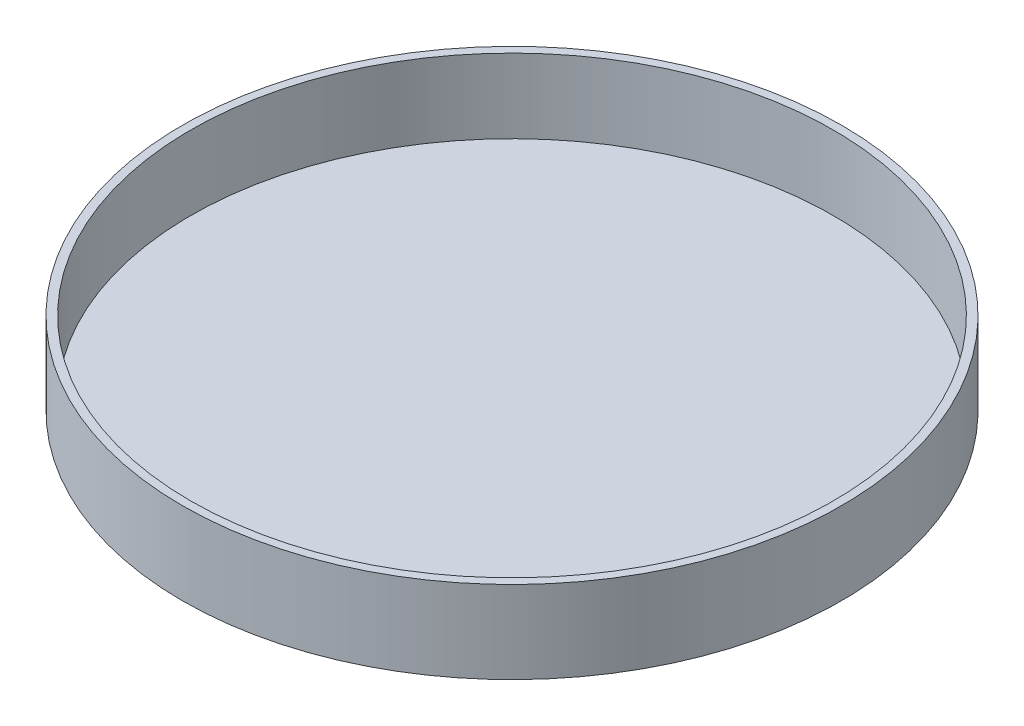
ISO-10303-21;
HEADER;
FILE_DESCRIPTION(('STEP AP214'),'2;1');
FILE_NAME('part.step','',(''),(''),'','','');
FILE_SCHEMA(('AUTOMOTIVE_DESIGN { 1 0 10303 214 1 1 1 1 }'));
ENDSEC;
DATA;
#1=APPLICATION_CONTEXT('core data for automotive mechanical design processes');
#2=APPLICATION_PROTOCOL_DEFINITION('international standard','automotive_design',2000,#1);
#3=PRODUCT_CONTEXT('',#1,'mechanical');
#4=PRODUCT('Part','Part','',(#3));
#5=PRODUCT_RELATED_PRODUCT_CATEGORY('part','',(#4));
#6=PRODUCT_DEFINITION_FORMATION('','',#4);
#7=PRODUCT_DEFINITION_CONTEXT('part definition',#1,'design');
#8=PRODUCT_DEFINITION('design','',#6,#7);
#9=PRODUCT_DEFINITION_SHAPE('','',#8);
#10=(LENGTH_UNIT() NAMED_UNIT(*) SI_UNIT(.MILLI.,.METRE.));
#11=(NAMED_UNIT(*) PLANE_ANGLE_UNIT() SI_UNIT($,.RADIAN.));
#12=(NAMED_UNIT(*) SI_UNIT($,.STERADIAN.) SOLID_ANGLE_UNIT());
#13=UNCERTAINTY_MEASURE_WITH_UNIT(LENGTH_MEASURE(1.E-05),#10,'distance_accuracy_value','');
#14=(GEOMETRIC_REPRESENTATION_CONTEXT(3) GLOBAL_UNCERTAINTY_ASSIGNED_CONTEXT((#13)) GLOBAL_UNIT_ASSIGNED_CONTEXT((#10,
#11,#12)) REPRESENTATION_CONTEXT('',''));
#15=CARTESIAN_POINT('',(0.,0.,0.));
#16=DIRECTION('',(0.,0.,1.));
#17=DIRECTION('',(1.,0.,0.));
#18=AXIS2_PLACEMENT_3D('',#15,#16,#17);
#19=CARTESIAN_POINT('',(0.,40.,0.));
#20=DIRECTION('',(0.,-1.,0.));
#21=DIRECTION('',(0.,0.,-1.));
#22=AXIS2_PLACEMENT_3D('',#19,#20,#21);
#23=CYLINDRICAL_SURFACE('',#22,160.);
#24=CARTESIAN_POINT('',(0.,40.,0.));
#25=DIRECTION('',(0.,1.,0.));
#26=DIRECTION('',(0.,0.,1.));
#27=AXIS2_PLACEMENT_3D('',#24,#25,#26);
#28=CIRCLE('',#27,160.);
#29=CARTESIAN_POINT('',(0.,40.,160.));
#30=VERTEX_POINT('',#29);
#31=EDGE_CURVE('E10',#30,#30,#28,.T.);
#32=ORIENTED_EDGE('',*,*,#31,.F.);
#33=EDGE_LOOP('',(#32));
#34=FACE_BOUND('',#33,.T.);
#35=CARTESIAN_POINT('',(0.,0.,0.));
#36=DIRECTION('',(0.,1.,0.));
#37=DIRECTION('',(0.,0.,1.));
#38=AXIS2_PLACEMENT_3D('',#35,#36,#37);
#39=CIRCLE('',#38,160.);
#40=CARTESIAN_POINT('',(0.,0.,160.));
#41=VERTEX_POINT('',#40);
#42=EDGE_CURVE('E34',#41,#41,#39,.T.);
#43=ORIENTED_EDGE('',*,*,#42,.T.);
#44=EDGE_LOOP('',(#43));
#45=FACE_BOUND('',#44,.T.);
#46=ADVANCED_FACE('F31',(#34,#45),#23,.T.);
#47=CARTESIAN_POINT('',(0.,40.,0.));
#48=DIRECTION('',(0.,1.,0.));
#49=DIRECTION('',(0.,0.,1.));
#50=AXIS2_PLACEMENT_3D('',#47,#48,#49);
#51=PLANE('',#50);
#52=CARTESIAN_POINT('',(0.,40.,0.));
#53=DIRECTION('',(0.,1.,0.));
#54=DIRECTION('',(0.,0.,1.));
#55=AXIS2_PLACEMENT_3D('',#52,#53,#54);
#56=CIRCLE('',#55,156.);
#57=CARTESIAN_POINT('',(0.,40.,156.));
#58=VERTEX_POINT('',#57);
#59=EDGE_CURVE('E41',#58,#58,#56,.T.);
#60=ORIENTED_EDGE('',*,*,#59,.F.);
#61=EDGE_LOOP('',(#60));
#62=FACE_BOUND('',#61,.T.);
#63=ORIENTED_EDGE('',*,*,#31,.T.);
#64=EDGE_LOOP('',(#63));
#65=FACE_BOUND('',#64,.T.);
#66=ADVANCED_FACE('F61',(#62,#65),#51,.T.);
#67=CARTESIAN_POINT('',(0.,0.,0.));
#68=DIRECTION('',(0.,1.,0.));
#69=DIRECTION('',(0.,0.,1.));
#70=AXIS2_PLACEMENT_3D('',#67,#68,#69);
#71=PLANE('',#70);
#72=ORIENTED_EDGE('',*,*,#42,.F.);
#73=EDGE_LOOP('',(#72));
#74=FACE_BOUND('',#73,.T.);
#75=ADVANCED_FACE('F53',(#74),#71,.F.);
#76=CARTESIAN_POINT('',(0.,36.,0.));
#77=DIRECTION('',(0.,1.,0.));
#78=DIRECTION('',(0.,0.,1.));
#79=AXIS2_PLACEMENT_3D('',#76,#77,#78);
#80=CYLINDRICAL_SURFACE('',#79,156.);
#81=ORIENTED_EDGE('',*,*,#59,.T.);
#82=EDGE_LOOP('',(#81));
#83=FACE_BOUND('',#82,.T.);
#84=CARTESIAN_POINT('',(0.,4.,0.));
#85=DIRECTION('',(0.,1.,0.));
#86=DIRECTION('',(0.,0.,1.));
#87=AXIS2_PLACEMENT_3D('',#84,#85,#86);
#88=CIRCLE('',#87,156.);
#89=CARTESIAN_POINT('',(0.,4.,156.));
#90=VERTEX_POINT('',#89);
#91=EDGE_CURVE('E45',#90,#90,#88,.T.);
#92=ORIENTED_EDGE('',*,*,#91,.F.);
#93=EDGE_LOOP('',(#92));
#94=FACE_BOUND('',#93,.T.);
#95=ADVANCED_FACE('F51',(#83,#94),#80,.F.);
#96=CARTESIAN_POINT('',(0.,4.,0.));
#97=DIRECTION('',(0.,1.,0.));
#98=DIRECTION('',(0.,0.,1.));
#99=AXIS2_PLACEMENT_3D('',#96,#97,#98);
#100=PLANE('',#99);
#101=ORIENTED_EDGE('',*,*,#91,.T.);
#102=EDGE_LOOP('',(#101));
#103=FACE_BOUND('',#102,.T.);
#104=ADVANCED_FACE('F49',(#103),#100,.T.);
#105=CLOSED_SHELL('',(#46,#66,#75,#95,#104));
#106=MANIFOLD_SOLID_BREP('B2',#105);
#107=ADVANCED_BREP_SHAPE_REPRESENTATION('',(#18,#106),#14);
#108=SHAPE_DEFINITION_REPRESENTATION(#9,#107);
ENDSEC;
END-ISO-10303-21;
